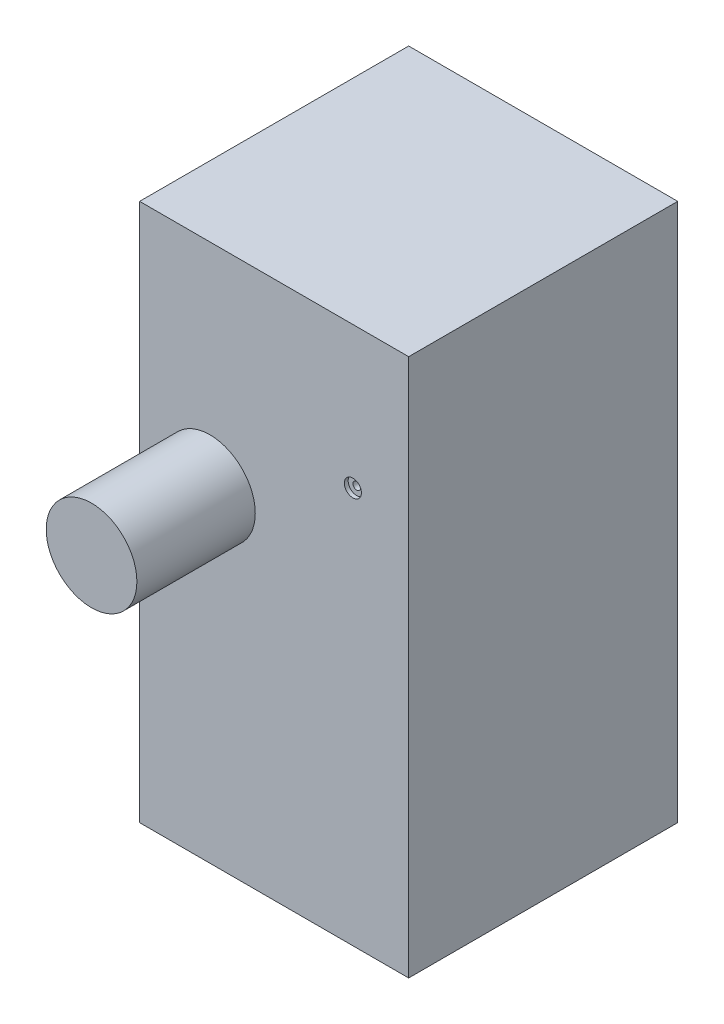
ISO-10303-21;
HEADER;
FILE_DESCRIPTION(('STEP AP214'),'2;1');
FILE_NAME('part.step','',(''),(''),'','','');
FILE_SCHEMA(('AUTOMOTIVE_DESIGN { 1 0 10303 214 1 1 1 1 }'));
ENDSEC;
DATA;
#1=APPLICATION_CONTEXT('core data for automotive mechanical design processes');
#2=APPLICATION_PROTOCOL_DEFINITION('international standard','automotive_design',2000,#1);
#3=PRODUCT_CONTEXT('',#1,'mechanical');
#4=PRODUCT('Part','Part','',(#3));
#5=PRODUCT_RELATED_PRODUCT_CATEGORY('part','',(#4));
#6=PRODUCT_DEFINITION_FORMATION('','',#4);
#7=PRODUCT_DEFINITION_CONTEXT('part definition',#1,'design');
#8=PRODUCT_DEFINITION('design','',#6,#7);
#9=PRODUCT_DEFINITION_SHAPE('','',#8);
#10=(LENGTH_UNIT() NAMED_UNIT(*) SI_UNIT(.MILLI.,.METRE.));
#11=(NAMED_UNIT(*) PLANE_ANGLE_UNIT() SI_UNIT($,.RADIAN.));
#12=(NAMED_UNIT(*) SI_UNIT($,.STERADIAN.) SOLID_ANGLE_UNIT());
#13=UNCERTAINTY_MEASURE_WITH_UNIT(LENGTH_MEASURE(1.E-05),#10,'distance_accuracy_value','');
#14=(GEOMETRIC_REPRESENTATION_CONTEXT(3) GLOBAL_UNCERTAINTY_ASSIGNED_CONTEXT((#13)) GLOBAL_UNIT_ASSIGNED_CONTEXT((#10,
#11,#12)) REPRESENTATION_CONTEXT('',''));
#15=CARTESIAN_POINT('',(0.,0.,0.));
#16=DIRECTION('',(0.,0.,1.));
#17=DIRECTION('',(1.,0.,0.));
#18=AXIS2_PLACEMENT_3D('',#15,#16,#17);
#19=CARTESIAN_POINT('',(0.,100.,-50.));
#20=DIRECTION('',(0.,0.,1.));
#21=DIRECTION('',(1.,0.,0.));
#22=AXIS2_PLACEMENT_3D('',#19,#20,#21);
#23=PLANE('',#22);
#24=CARTESIAN_POINT('',(-10.3678802784088,73.6788542191107,-50.));
#25=DIRECTION('',(0.,0.,1.));
#26=DIRECTION('',(1.,0.,0.));
#27=AXIS2_PLACEMENT_3D('',#24,#25,#26);
#28=CIRCLE('',#27,0.698499999999987);
#29=CARTESIAN_POINT('',(-9.66938027840886,73.6788542191107,-50.));
#30=VERTEX_POINT('',#29);
#31=EDGE_CURVE('E130',#30,#30,#28,.T.);
#32=ORIENTED_EDGE('',*,*,#31,.T.);
#33=EDGE_LOOP('',(#32));
#34=FACE_BOUND('',#33,.T.);
#35=DIRECTION('',(-1.,0.,0.));
#36=VECTOR('',#35,1.);
#37=CARTESIAN_POINT('',(0.,0.,-50.));
#38=LINE('',#37,#36);
#39=CARTESIAN_POINT('',(0.,0.,-50.));
#40=VERTEX_POINT('',#39);
#41=CARTESIAN_POINT('',(-50.,0.,-50.));
#42=VERTEX_POINT('',#41);
#43=EDGE_CURVE('E97',#40,#42,#38,.T.);
#44=ORIENTED_EDGE('',*,*,#43,.T.);
#45=DIRECTION('',(0.,-1.,0.));
#46=VECTOR('',#45,1.);
#47=CARTESIAN_POINT('',(-50.,100.,-50.));
#48=LINE('',#47,#46);
#49=CARTESIAN_POINT('',(-50.,100.,-50.));
#50=VERTEX_POINT('',#49);
#51=EDGE_CURVE('E11',#50,#42,#48,.T.);
#52=ORIENTED_EDGE('',*,*,#51,.F.);
#53=DIRECTION('',(-1.,0.,0.));
#54=VECTOR('',#53,1.);
#55=CARTESIAN_POINT('',(0.,100.,-50.));
#56=LINE('',#55,#54);
#57=CARTESIAN_POINT('',(0.,100.,-50.));
#58=VERTEX_POINT('',#57);
#59=EDGE_CURVE('E74',#58,#50,#56,.T.);
#60=ORIENTED_EDGE('',*,*,#59,.F.);
#61=DIRECTION('',(0.,-1.,0.));
#62=VECTOR('',#61,1.);
#63=CARTESIAN_POINT('',(0.,100.,-50.));
#64=LINE('',#63,#62);
#65=EDGE_CURVE('E93',#58,#40,#64,.T.);
#66=ORIENTED_EDGE('',*,*,#65,.T.);
#67=EDGE_LOOP('',(#44,#52,#60,#66));
#68=FACE_BOUND('',#67,.T.);
#69=ADVANCED_FACE('F35',(#34,#68),#23,.F.);
#70=CARTESIAN_POINT('',(-50.,100.,0.));
#71=DIRECTION('',(-1.,0.,0.));
#72=DIRECTION('',(0.,0.,1.));
#73=AXIS2_PLACEMENT_3D('',#70,#71,#72);
#74=PLANE('',#73);
#75=DIRECTION('',(0.,0.,-1.));
#76=VECTOR('',#75,1.);
#77=CARTESIAN_POINT('',(-50.,0.,0.));
#78=LINE('',#77,#76);
#79=CARTESIAN_POINT('',(-50.,0.,0.));
#80=VERTEX_POINT('',#79);
#81=EDGE_CURVE('E83',#80,#42,#78,.T.);
#82=ORIENTED_EDGE('',*,*,#81,.F.);
#83=DIRECTION('',(0.,-1.,0.));
#84=VECTOR('',#83,1.);
#85=CARTESIAN_POINT('',(-50.,100.,0.));
#86=LINE('',#85,#84);
#87=CARTESIAN_POINT('',(-50.,100.,0.));
#88=VERTEX_POINT('',#87);
#89=EDGE_CURVE('E43',#88,#80,#86,.T.);
#90=ORIENTED_EDGE('',*,*,#89,.F.);
#91=DIRECTION('',(0.,0.,-1.));
#92=VECTOR('',#91,1.);
#93=CARTESIAN_POINT('',(-50.,100.,0.));
#94=LINE('',#93,#92);
#95=EDGE_CURVE('E81',#88,#50,#94,.T.);
#96=ORIENTED_EDGE('',*,*,#95,.T.);
#97=ORIENTED_EDGE('',*,*,#51,.T.);
#98=EDGE_LOOP('',(#82,#90,#96,#97));
#99=FACE_BOUND('',#98,.T.);
#100=ADVANCED_FACE('F80',(#99),#74,.T.);
#101=CARTESIAN_POINT('',(0.,100.,0.));
#102=DIRECTION('',(0.,0.,1.));
#103=DIRECTION('',(1.,0.,0.));
#104=AXIS2_PLACEMENT_3D('',#101,#102,#103);
#105=PLANE('',#104);
#106=CARTESIAN_POINT('',(-10.3678802784088,73.6788542191107,0.));
#107=DIRECTION('',(0.,0.,1.));
#108=DIRECTION('',(1.,0.,0.));
#109=AXIS2_PLACEMENT_3D('',#106,#107,#108);
#110=CIRCLE('',#109,1.5875);
#111=CARTESIAN_POINT('',(-8.78038027840885,73.6788542191107,0.));
#112=VERTEX_POINT('',#111);
#113=EDGE_CURVE('E156',#112,#112,#110,.T.);
#114=ORIENTED_EDGE('',*,*,#113,.F.);
#115=EDGE_LOOP('',(#114));
#116=FACE_BOUND('',#115,.T.);
#117=CARTESIAN_POINT('',(-36.9369428035498,60.5397444959976,0.));
#118=DIRECTION('',(0.,0.,1.));
#119=DIRECTION('',(1.,0.,0.));
#120=AXIS2_PLACEMENT_3D('',#117,#118,#119);
#121=CIRCLE('',#120,8.42715592654481);
#122=CARTESIAN_POINT('',(-28.5097868770049,60.5397444959976,0.));
#123=VERTEX_POINT('',#122);
#124=EDGE_CURVE('E132',#123,#123,#121,.T.);
#125=ORIENTED_EDGE('',*,*,#124,.F.);
#126=EDGE_LOOP('',(#125));
#127=FACE_BOUND('',#126,.T.);
#128=DIRECTION('',(-1.,0.,0.));
#129=VECTOR('',#128,1.);
#130=CARTESIAN_POINT('',(0.,0.,0.));
#131=LINE('',#130,#129);
#132=CARTESIAN_POINT('',(0.,0.,0.));
#133=VERTEX_POINT('',#132);
#134=EDGE_CURVE('E102',#133,#80,#131,.T.);
#135=ORIENTED_EDGE('',*,*,#134,.F.);
#136=DIRECTION('',(0.,-1.,0.));
#137=VECTOR('',#136,1.);
#138=CARTESIAN_POINT('',(0.,100.,0.));
#139=LINE('',#138,#137);
#140=CARTESIAN_POINT('',(0.,100.,0.));
#141=VERTEX_POINT('',#140);
#142=EDGE_CURVE('E66',#141,#133,#139,.T.);
#143=ORIENTED_EDGE('',*,*,#142,.F.);
#144=DIRECTION('',(-1.,0.,0.));
#145=VECTOR('',#144,1.);
#146=CARTESIAN_POINT('',(0.,100.,0.));
#147=LINE('',#146,#145);
#148=EDGE_CURVE('E89',#141,#88,#147,.T.);
#149=ORIENTED_EDGE('',*,*,#148,.T.);
#150=ORIENTED_EDGE('',*,*,#89,.T.);
#151=EDGE_LOOP('',(#135,#143,#149,#150));
#152=FACE_BOUND('',#151,.T.);
#153=ADVANCED_FACE('F91',(#116,#127,#152),#105,.T.);
#154=CARTESIAN_POINT('',(0.,100.,0.));
#155=DIRECTION('',(-1.,0.,0.));
#156=DIRECTION('',(0.,0.,1.));
#157=AXIS2_PLACEMENT_3D('',#154,#155,#156);
#158=PLANE('',#157);
#159=DIRECTION('',(0.,0.,-1.));
#160=VECTOR('',#159,1.);
#161=CARTESIAN_POINT('',(0.,0.,0.));
#162=LINE('',#161,#160);
#163=EDGE_CURVE('E69',#133,#40,#162,.T.);
#164=ORIENTED_EDGE('',*,*,#163,.T.);
#165=ORIENTED_EDGE('',*,*,#65,.F.);
#166=DIRECTION('',(0.,0.,-1.));
#167=VECTOR('',#166,1.);
#168=CARTESIAN_POINT('',(0.,100.,0.));
#169=LINE('',#168,#167);
#170=EDGE_CURVE('E51',#141,#58,#169,.T.);
#171=ORIENTED_EDGE('',*,*,#170,.F.);
#172=ORIENTED_EDGE('',*,*,#142,.T.);
#173=EDGE_LOOP('',(#164,#165,#171,#172));
#174=FACE_BOUND('',#173,.T.);
#175=ADVANCED_FACE('F120',(#174),#158,.F.);
#176=CARTESIAN_POINT('',(0.,100.,0.));
#177=DIRECTION('',(0.,-1.,0.));
#178=DIRECTION('',(0.,0.,-1.));
#179=AXIS2_PLACEMENT_3D('',#176,#177,#178);
#180=PLANE('',#179);
#181=ORIENTED_EDGE('',*,*,#59,.T.);
#182=ORIENTED_EDGE('',*,*,#95,.F.);
#183=ORIENTED_EDGE('',*,*,#148,.F.);
#184=ORIENTED_EDGE('',*,*,#170,.T.);
#185=EDGE_LOOP('',(#181,#182,#183,#184));
#186=FACE_BOUND('',#185,.T.);
#187=ADVANCED_FACE('F88',(#186),#180,.F.);
#188=CARTESIAN_POINT('',(0.,0.,0.));
#189=DIRECTION('',(0.,-1.,0.));
#190=DIRECTION('',(0.,0.,-1.));
#191=AXIS2_PLACEMENT_3D('',#188,#189,#190);
#192=PLANE('',#191);
#193=ORIENTED_EDGE('',*,*,#43,.F.);
#194=ORIENTED_EDGE('',*,*,#163,.F.);
#195=ORIENTED_EDGE('',*,*,#134,.T.);
#196=ORIENTED_EDGE('',*,*,#81,.T.);
#197=EDGE_LOOP('',(#193,#194,#195,#196));
#198=FACE_BOUND('',#197,.T.);
#199=ADVANCED_FACE('F109',(#198),#192,.T.);
#200=CARTESIAN_POINT('',(-36.9369428035498,60.5397444959976,22.));
#201=DIRECTION('',(0.,0.,-1.));
#202=DIRECTION('',(-1.,0.,0.));
#203=AXIS2_PLACEMENT_3D('',#200,#201,#202);
#204=CYLINDRICAL_SURFACE('',#203,8.42715592654481);
#205=CARTESIAN_POINT('',(-36.9369428035498,60.5397444959976,22.));
#206=DIRECTION('',(0.,0.,1.));
#207=DIRECTION('',(1.,0.,0.));
#208=AXIS2_PLACEMENT_3D('',#205,#206,#207);
#209=CIRCLE('',#208,8.42715592654481);
#210=CARTESIAN_POINT('',(-28.5097868770049,60.5397444959976,22.));
#211=VERTEX_POINT('',#210);
#212=EDGE_CURVE('E100',#211,#211,#209,.T.);
#213=ORIENTED_EDGE('',*,*,#212,.F.);
#214=EDGE_LOOP('',(#213));
#215=FACE_BOUND('',#214,.T.);
#216=ORIENTED_EDGE('',*,*,#124,.T.);
#217=EDGE_LOOP('',(#216));
#218=FACE_BOUND('',#217,.T.);
#219=ADVANCED_FACE('F111',(#215,#218),#204,.T.);
#220=CARTESIAN_POINT('',(-36.9369428035498,60.5397444959976,22.));
#221=DIRECTION('',(0.,0.,1.));
#222=DIRECTION('',(1.,0.,0.));
#223=AXIS2_PLACEMENT_3D('',#220,#221,#222);
#224=PLANE('',#223);
#225=ORIENTED_EDGE('',*,*,#212,.T.);
#226=EDGE_LOOP('',(#225));
#227=FACE_BOUND('',#226,.T.);
#228=ADVANCED_FACE('F117',(#227),#224,.T.);
#229=CARTESIAN_POINT('',(-10.3678802784088,73.6788542191107,0.));
#230=DIRECTION('',(0.,0.,1.));
#231=DIRECTION('',(1.,0.,0.));
#232=AXIS2_PLACEMENT_3D('',#229,#230,#231);
#233=CYLINDRICAL_SURFACE('',#232,0.698499999999993);
#234=ORIENTED_EDGE('',*,*,#31,.F.);
#235=EDGE_LOOP('',(#234));
#236=FACE_BOUND('',#235,.T.);
#237=CARTESIAN_POINT('',(-10.3678802784088,73.6788542191107,-0.711199999999999));
#238=DIRECTION('',(0.,0.,1.));
#239=DIRECTION('',(1.,0.,0.));
#240=AXIS2_PLACEMENT_3D('',#237,#238,#239);
#241=CIRCLE('',#240,0.698499999999999);
#242=CARTESIAN_POINT('',(-9.66938027840885,73.6788542191107,-0.711199999999999));
#243=VERTEX_POINT('',#242);
#244=EDGE_CURVE('E133',#243,#243,#241,.T.);
#245=ORIENTED_EDGE('',*,*,#244,.T.);
#246=EDGE_LOOP('',(#245));
#247=FACE_BOUND('',#246,.T.);
#248=ADVANCED_FACE('F170',(#236,#247),#233,.F.);
#249=CARTESIAN_POINT('',(-9.66938027840885,73.6788542191107,-0.711199999999999));
#250=DIRECTION('',(0.,0.,-1.));
#251=DIRECTION('',(-1.,0.,0.));
#252=AXIS2_PLACEMENT_3D('',#249,#250,#251);
#253=PLANE('',#252);
#254=ORIENTED_EDGE('',*,*,#244,.F.);
#255=EDGE_LOOP('',(#254));
#256=FACE_BOUND('',#255,.T.);
#257=CARTESIAN_POINT('',(-10.3678802784088,73.6788542191107,-0.711199999999999));
#258=DIRECTION('',(0.,0.,1.));
#259=DIRECTION('',(1.,0.,0.));
#260=AXIS2_PLACEMENT_3D('',#257,#258,#259);
#261=CIRCLE('',#260,1.5875);
#262=CARTESIAN_POINT('',(-8.78038027840885,73.6788542191107,-0.711199999999999));
#263=VERTEX_POINT('',#262);
#264=EDGE_CURVE('E138',#263,#263,#261,.T.);
#265=ORIENTED_EDGE('',*,*,#264,.T.);
#266=EDGE_LOOP('',(#265));
#267=FACE_BOUND('',#266,.T.);
#268=ADVANCED_FACE('F162',(#256,#267),#253,.F.);
#269=CARTESIAN_POINT('',(-10.3678802784088,73.6788542191107,0.));
#270=DIRECTION('',(0.,0.,1.));
#271=DIRECTION('',(1.,0.,0.));
#272=AXIS2_PLACEMENT_3D('',#269,#270,#271);
#273=CYLINDRICAL_SURFACE('',#272,1.5875);
#274=ORIENTED_EDGE('',*,*,#264,.F.);
#275=EDGE_LOOP('',(#274));
#276=FACE_BOUND('',#275,.T.);
#277=ORIENTED_EDGE('',*,*,#113,.T.);
#278=EDGE_LOOP('',(#277));
#279=FACE_BOUND('',#278,.T.);
#280=ADVANCED_FACE('F164',(#276,#279),#273,.F.);
#281=CLOSED_SHELL('',(#69,#100,#153,#175,#187,#199,#219,#228,#248,#268,#280));
#282=MANIFOLD_SOLID_BREP('B2',#281);
#283=ADVANCED_BREP_SHAPE_REPRESENTATION('',(#18,#282),#14);
#284=SHAPE_DEFINITION_REPRESENTATION(#9,#283);
ENDSEC;
END-ISO-10303-21;
